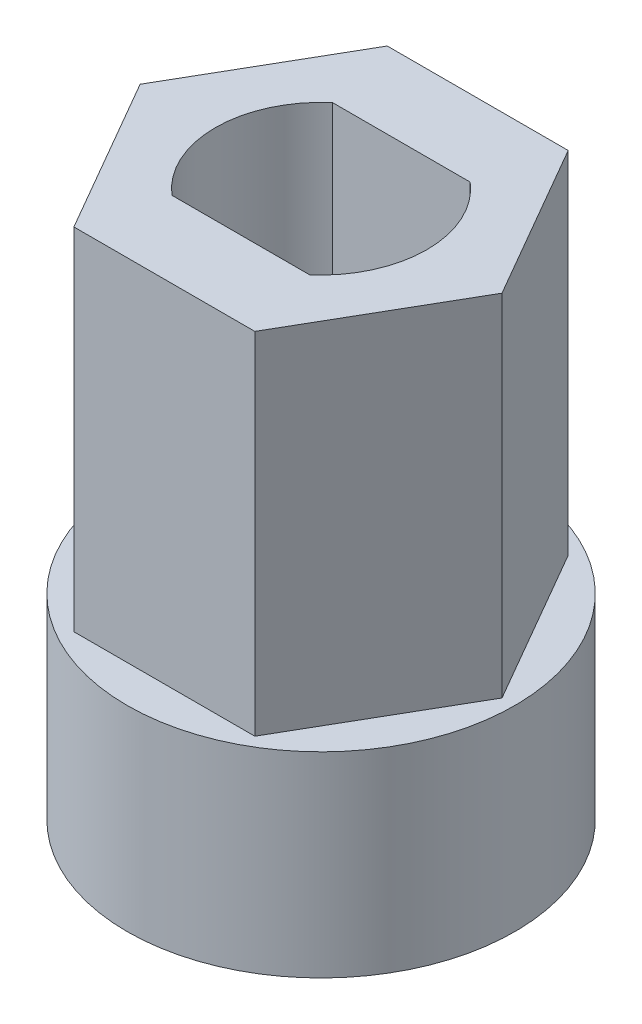
ISO-10303-21;
HEADER;
FILE_DESCRIPTION(('STEP AP214'),'2;1');
FILE_NAME('part.step','',(''),(''),'','','');
FILE_SCHEMA(('AUTOMOTIVE_DESIGN { 1 0 10303 214 1 1 1 1 }'));
ENDSEC;
DATA;
#1=APPLICATION_CONTEXT('core data for automotive mechanical design processes');
#2=APPLICATION_PROTOCOL_DEFINITION('international standard','automotive_design',2000,#1);
#3=PRODUCT_CONTEXT('',#1,'mechanical');
#4=PRODUCT('Part','Part','',(#3));
#5=PRODUCT_RELATED_PRODUCT_CATEGORY('part','',(#4));
#6=PRODUCT_DEFINITION_FORMATION('','',#4);
#7=PRODUCT_DEFINITION_CONTEXT('part definition',#1,'design');
#8=PRODUCT_DEFINITION('design','',#6,#7);
#9=PRODUCT_DEFINITION_SHAPE('','',#8);
#10=(LENGTH_UNIT() NAMED_UNIT(*) SI_UNIT(.MILLI.,.METRE.));
#11=(NAMED_UNIT(*) PLANE_ANGLE_UNIT() SI_UNIT($,.RADIAN.));
#12=(NAMED_UNIT(*) SI_UNIT($,.STERADIAN.) SOLID_ANGLE_UNIT());
#13=UNCERTAINTY_MEASURE_WITH_UNIT(LENGTH_MEASURE(1.E-05),#10,'distance_accuracy_value','');
#14=(GEOMETRIC_REPRESENTATION_CONTEXT(3) GLOBAL_UNCERTAINTY_ASSIGNED_CONTEXT((#13)) GLOBAL_UNIT_ASSIGNED_CONTEXT((#10,
#11,#12)) REPRESENTATION_CONTEXT('',''));
#15=CARTESIAN_POINT('',(0.,0.,0.));
#16=DIRECTION('',(0.,0.,1.));
#17=DIRECTION('',(1.,0.,0.));
#18=AXIS2_PLACEMENT_3D('',#15,#16,#17);
#19=CARTESIAN_POINT('',(3.46410161513775,8.95,2.));
#20=DIRECTION('',(-0.866025403784438,0.,-0.5));
#21=DIRECTION('',(-0.5,0.,0.866025403784439));
#22=AXIS2_PLACEMENT_3D('',#19,#20,#21);
#23=PLANE('',#22);
#24=DIRECTION('',(0.5,0.,-0.866025403784439));
#25=VECTOR('',#24,1.);
#26=CARTESIAN_POINT('',(3.46410161513775,0.,2.));
#27=LINE('',#26,#25);
#28=CARTESIAN_POINT('',(2.3094010767585,0.,4.));
#29=VERTEX_POINT('',#28);
#30=CARTESIAN_POINT('',(4.61880215351701,0.,0.));
#31=VERTEX_POINT('',#30);
#32=EDGE_CURVE('E158',#29,#31,#27,.T.);
#33=ORIENTED_EDGE('',*,*,#32,.T.);
#34=DIRECTION('',(0.,-1.,0.));
#35=VECTOR('',#34,1.);
#36=CARTESIAN_POINT('',(4.61880215351701,8.95,0.));
#37=LINE('',#36,#35);
#38=CARTESIAN_POINT('',(4.61880215351701,8.95,0.));
#39=VERTEX_POINT('',#38);
#40=EDGE_CURVE('E11',#39,#31,#37,.T.);
#41=ORIENTED_EDGE('',*,*,#40,.F.);
#42=DIRECTION('',(0.5,0.,-0.866025403784439));
#43=VECTOR('',#42,1.);
#44=CARTESIAN_POINT('',(3.46410161513775,8.95,2.));
#45=LINE('',#44,#43);
#46=CARTESIAN_POINT('',(2.3094010767585,8.95,4.));
#47=VERTEX_POINT('',#46);
#48=EDGE_CURVE('E175',#47,#39,#45,.T.);
#49=ORIENTED_EDGE('',*,*,#48,.F.);
#50=DIRECTION('',(0.,-1.,0.));
#51=VECTOR('',#50,1.);
#52=CARTESIAN_POINT('',(2.3094010767585,8.95,4.));
#53=LINE('',#52,#51);
#54=EDGE_CURVE('E129',#47,#29,#53,.T.);
#55=ORIENTED_EDGE('',*,*,#54,.T.);
#56=EDGE_LOOP('',(#33,#41,#49,#55));
#57=FACE_BOUND('',#56,.T.);
#58=ADVANCED_FACE('F43',(#57),#23,.F.);
#59=CARTESIAN_POINT('',(3.46410161513775,8.95,-2.));
#60=DIRECTION('',(-0.866025403784439,0.,0.5));
#61=DIRECTION('',(0.5,0.,0.866025403784439));
#62=AXIS2_PLACEMENT_3D('',#59,#60,#61);
#63=PLANE('',#62);
#64=DIRECTION('',(-0.5,0.,-0.866025403784439));
#65=VECTOR('',#64,1.);
#66=CARTESIAN_POINT('',(3.46410161513775,0.,-2.));
#67=LINE('',#66,#65);
#68=CARTESIAN_POINT('',(2.3094010767585,0.,-4.));
#69=VERTEX_POINT('',#68);
#70=EDGE_CURVE('E195',#31,#69,#67,.T.);
#71=ORIENTED_EDGE('',*,*,#70,.T.);
#72=DIRECTION('',(0.,-1.,0.));
#73=VECTOR('',#72,1.);
#74=CARTESIAN_POINT('',(2.3094010767585,8.95,-4.));
#75=LINE('',#74,#73);
#76=CARTESIAN_POINT('',(2.3094010767585,8.95,-4.));
#77=VERTEX_POINT('',#76);
#78=EDGE_CURVE('E54',#77,#69,#75,.T.);
#79=ORIENTED_EDGE('',*,*,#78,.F.);
#80=DIRECTION('',(-0.5,0.,-0.866025403784439));
#81=VECTOR('',#80,1.);
#82=CARTESIAN_POINT('',(3.46410161513775,8.95,-2.));
#83=LINE('',#82,#81);
#84=EDGE_CURVE('E178',#39,#77,#83,.T.);
#85=ORIENTED_EDGE('',*,*,#84,.F.);
#86=ORIENTED_EDGE('',*,*,#40,.T.);
#87=EDGE_LOOP('',(#71,#79,#85,#86));
#88=FACE_BOUND('',#87,.T.);
#89=ADVANCED_FACE('F258',(#88),#63,.F.);
#90=CARTESIAN_POINT('',(0.,8.95,-4.));
#91=DIRECTION('',(0.,0.,1.));
#92=DIRECTION('',(1.,0.,0.));
#93=AXIS2_PLACEMENT_3D('',#90,#91,#92);
#94=PLANE('',#93);
#95=DIRECTION('',(-1.,0.,0.));
#96=VECTOR('',#95,1.);
#97=CARTESIAN_POINT('',(0.,0.,-4.));
#98=LINE('',#97,#96);
#99=CARTESIAN_POINT('',(-2.3094010767585,0.,-4.));
#100=VERTEX_POINT('',#99);
#101=EDGE_CURVE('E199',#69,#100,#98,.T.);
#102=ORIENTED_EDGE('',*,*,#101,.T.);
#103=DIRECTION('',(0.,-1.,0.));
#104=VECTOR('',#103,1.);
#105=CARTESIAN_POINT('',(-2.3094010767585,8.95,-4.));
#106=LINE('',#105,#104);
#107=CARTESIAN_POINT('',(-2.3094010767585,8.95,-4.));
#108=VERTEX_POINT('',#107);
#109=EDGE_CURVE('E225',#108,#100,#106,.T.);
#110=ORIENTED_EDGE('',*,*,#109,.F.);
#111=DIRECTION('',(-1.,0.,0.));
#112=VECTOR('',#111,1.);
#113=CARTESIAN_POINT('',(0.,8.95,-4.));
#114=LINE('',#113,#112);
#115=EDGE_CURVE('E181',#77,#108,#114,.T.);
#116=ORIENTED_EDGE('',*,*,#115,.F.);
#117=ORIENTED_EDGE('',*,*,#78,.T.);
#118=EDGE_LOOP('',(#102,#110,#116,#117));
#119=FACE_BOUND('',#118,.T.);
#120=ADVANCED_FACE('F263',(#119),#94,.F.);
#121=CARTESIAN_POINT('',(-3.46410161513775,8.95,-2.));
#122=DIRECTION('',(0.866025403784439,0.,0.5));
#123=DIRECTION('',(0.5,0.,-0.866025403784439));
#124=AXIS2_PLACEMENT_3D('',#121,#122,#123);
#125=PLANE('',#124);
#126=DIRECTION('',(-0.5,0.,0.866025403784439));
#127=VECTOR('',#126,1.);
#128=CARTESIAN_POINT('',(-3.46410161513775,0.,-2.));
#129=LINE('',#128,#127);
#130=CARTESIAN_POINT('',(-4.61880215351701,0.,0.));
#131=VERTEX_POINT('',#130);
#132=EDGE_CURVE('E203',#100,#131,#129,.T.);
#133=ORIENTED_EDGE('',*,*,#132,.T.);
#134=DIRECTION('',(0.,-1.,0.));
#135=VECTOR('',#134,1.);
#136=CARTESIAN_POINT('',(-4.61880215351701,8.95,0.));
#137=LINE('',#136,#135);
#138=CARTESIAN_POINT('',(-4.61880215351701,8.95,0.));
#139=VERTEX_POINT('',#138);
#140=EDGE_CURVE('E221',#139,#131,#137,.T.);
#141=ORIENTED_EDGE('',*,*,#140,.F.);
#142=DIRECTION('',(-0.5,0.,0.866025403784439));
#143=VECTOR('',#142,1.);
#144=CARTESIAN_POINT('',(-3.46410161513775,8.95,-2.));
#145=LINE('',#144,#143);
#146=EDGE_CURVE('E184',#108,#139,#145,.T.);
#147=ORIENTED_EDGE('',*,*,#146,.F.);
#148=ORIENTED_EDGE('',*,*,#109,.T.);
#149=EDGE_LOOP('',(#133,#141,#147,#148));
#150=FACE_BOUND('',#149,.T.);
#151=ADVANCED_FACE('F269',(#150),#125,.F.);
#152=CARTESIAN_POINT('',(-3.46410161513775,8.95,2.));
#153=DIRECTION('',(0.866025403784438,0.,-0.5));
#154=DIRECTION('',(-0.5,0.,-0.866025403784439));
#155=AXIS2_PLACEMENT_3D('',#152,#153,#154);
#156=PLANE('',#155);
#157=DIRECTION('',(0.5,0.,0.866025403784439));
#158=VECTOR('',#157,1.);
#159=CARTESIAN_POINT('',(-3.46410161513775,0.,2.));
#160=LINE('',#159,#158);
#161=CARTESIAN_POINT('',(-2.3094010767585,0.,4.));
#162=VERTEX_POINT('',#161);
#163=EDGE_CURVE('E207',#131,#162,#160,.T.);
#164=ORIENTED_EDGE('',*,*,#163,.T.);
#165=DIRECTION('',(0.,-1.,0.));
#166=VECTOR('',#165,1.);
#167=CARTESIAN_POINT('',(-2.3094010767585,8.95,4.));
#168=LINE('',#167,#166);
#169=CARTESIAN_POINT('',(-2.3094010767585,8.95,4.));
#170=VERTEX_POINT('',#169);
#171=EDGE_CURVE('E217',#170,#162,#168,.T.);
#172=ORIENTED_EDGE('',*,*,#171,.F.);
#173=DIRECTION('',(0.5,0.,0.866025403784439));
#174=VECTOR('',#173,1.);
#175=CARTESIAN_POINT('',(-3.46410161513775,8.95,2.));
#176=LINE('',#175,#174);
#177=EDGE_CURVE('E187',#139,#170,#176,.T.);
#178=ORIENTED_EDGE('',*,*,#177,.F.);
#179=ORIENTED_EDGE('',*,*,#140,.T.);
#180=EDGE_LOOP('',(#164,#172,#178,#179));
#181=FACE_BOUND('',#180,.T.);
#182=ADVANCED_FACE('F273',(#181),#156,.F.);
#183=CARTESIAN_POINT('',(0.,8.95,0.));
#184=DIRECTION('',(0.,-1.,0.));
#185=DIRECTION('',(0.,0.,-1.));
#186=AXIS2_PLACEMENT_3D('',#183,#184,#185);
#187=CYLINDRICAL_SURFACE('',#186,2.7);
#188=DIRECTION('',(0.,-1.,0.));
#189=VECTOR('',#188,1.);
#190=CARTESIAN_POINT('',(1.75712833908056,8.95,-2.05));
#191=LINE('',#190,#189);
#192=CARTESIAN_POINT('',(1.75712833908056,8.95,-2.05));
#193=VERTEX_POINT('',#192);
#194=CARTESIAN_POINT('',(1.75712833908056,-5.,-2.05));
#195=VERTEX_POINT('',#194);
#196=EDGE_CURVE('E143',#193,#195,#191,.T.);
#197=ORIENTED_EDGE('',*,*,#196,.T.);
#198=CARTESIAN_POINT('',(0.,-5.,0.));
#199=DIRECTION('',(0.,1.,0.));
#200=DIRECTION('',(0.,0.,1.));
#201=AXIS2_PLACEMENT_3D('',#198,#199,#200);
#202=CIRCLE('',#201,2.7);
#203=CARTESIAN_POINT('',(1.75712833908056,-5.,2.05));
#204=VERTEX_POINT('',#203);
#205=EDGE_CURVE('E136',#204,#195,#202,.T.);
#206=ORIENTED_EDGE('',*,*,#205,.F.);
#207=DIRECTION('',(0.,-1.,0.));
#208=VECTOR('',#207,1.);
#209=CARTESIAN_POINT('',(1.75712833908056,8.95,2.05));
#210=LINE('',#209,#208);
#211=CARTESIAN_POINT('',(1.75712833908056,8.95,2.05));
#212=VERTEX_POINT('',#211);
#213=EDGE_CURVE('E47',#212,#204,#210,.T.);
#214=ORIENTED_EDGE('',*,*,#213,.F.);
#215=CARTESIAN_POINT('',(0.,8.95,0.));
#216=DIRECTION('',(0.,1.,0.));
#217=DIRECTION('',(0.,0.,1.));
#218=AXIS2_PLACEMENT_3D('',#215,#216,#217);
#219=CIRCLE('',#218,2.7);
#220=EDGE_CURVE('E162',#212,#193,#219,.T.);
#221=ORIENTED_EDGE('',*,*,#220,.T.);
#222=EDGE_LOOP('',(#197,#206,#214,#221));
#223=FACE_BOUND('',#222,.T.);
#224=ADVANCED_FACE('F45',(#223),#187,.F.);
#225=CARTESIAN_POINT('',(0.,8.95,2.05));
#226=DIRECTION('',(0.,0.,-1.));
#227=DIRECTION('',(-1.,0.,0.));
#228=AXIS2_PLACEMENT_3D('',#225,#226,#227);
#229=PLANE('',#228);
#230=ORIENTED_EDGE('',*,*,#213,.T.);
#231=DIRECTION('',(1.,0.,0.));
#232=VECTOR('',#231,1.);
#233=CARTESIAN_POINT('',(0.,-5.,2.05));
#234=LINE('',#233,#232);
#235=CARTESIAN_POINT('',(-1.75712833908056,-5.,2.05));
#236=VERTEX_POINT('',#235);
#237=EDGE_CURVE('E121',#236,#204,#234,.T.);
#238=ORIENTED_EDGE('',*,*,#237,.F.);
#239=DIRECTION('',(0.,-1.,0.));
#240=VECTOR('',#239,1.);
#241=CARTESIAN_POINT('',(-1.75712833908056,8.95,2.05));
#242=LINE('',#241,#240);
#243=CARTESIAN_POINT('',(-1.75712833908056,8.95,2.05));
#244=VERTEX_POINT('',#243);
#245=EDGE_CURVE('E130',#244,#236,#242,.T.);
#246=ORIENTED_EDGE('',*,*,#245,.F.);
#247=DIRECTION('',(1.,0.,0.));
#248=VECTOR('',#247,1.);
#249=CARTESIAN_POINT('',(0.,8.95,2.05));
#250=LINE('',#249,#248);
#251=EDGE_CURVE('E123',#244,#212,#250,.T.);
#252=ORIENTED_EDGE('',*,*,#251,.T.);
#253=EDGE_LOOP('',(#230,#238,#246,#252));
#254=FACE_BOUND('',#253,.T.);
#255=ADVANCED_FACE('F120',(#254),#229,.T.);
#256=CARTESIAN_POINT('',(0.,8.95,0.));
#257=DIRECTION('',(0.,-1.,0.));
#258=DIRECTION('',(0.,0.,-1.));
#259=AXIS2_PLACEMENT_3D('',#256,#257,#258);
#260=CYLINDRICAL_SURFACE('',#259,2.7);
#261=ORIENTED_EDGE('',*,*,#245,.T.);
#262=CARTESIAN_POINT('',(0.,-5.,0.));
#263=DIRECTION('',(0.,1.,0.));
#264=DIRECTION('',(0.,0.,1.));
#265=AXIS2_PLACEMENT_3D('',#262,#263,#264);
#266=CIRCLE('',#265,2.7);
#267=CARTESIAN_POINT('',(-1.75712833908056,-5.,-2.05));
#268=VERTEX_POINT('',#267);
#269=EDGE_CURVE('E139',#268,#236,#266,.T.);
#270=ORIENTED_EDGE('',*,*,#269,.F.);
#271=DIRECTION('',(0.,-1.,0.));
#272=VECTOR('',#271,1.);
#273=CARTESIAN_POINT('',(-1.75712833908056,8.95,-2.05));
#274=LINE('',#273,#272);
#275=CARTESIAN_POINT('',(-1.75712833908056,8.95,-2.05));
#276=VERTEX_POINT('',#275);
#277=EDGE_CURVE('E234',#276,#268,#274,.T.);
#278=ORIENTED_EDGE('',*,*,#277,.F.);
#279=CARTESIAN_POINT('',(0.,8.95,0.));
#280=DIRECTION('',(0.,1.,0.));
#281=DIRECTION('',(0.,0.,1.));
#282=AXIS2_PLACEMENT_3D('',#279,#280,#281);
#283=CIRCLE('',#282,2.7);
#284=EDGE_CURVE('E168',#276,#244,#283,.T.);
#285=ORIENTED_EDGE('',*,*,#284,.T.);
#286=EDGE_LOOP('',(#261,#270,#278,#285));
#287=FACE_BOUND('',#286,.T.);
#288=ADVANCED_FACE('F239',(#287),#260,.F.);
#289=CARTESIAN_POINT('',(0.,8.95,-2.05));
#290=DIRECTION('',(0.,0.,-1.));
#291=DIRECTION('',(-1.,0.,0.));
#292=AXIS2_PLACEMENT_3D('',#289,#290,#291);
#293=PLANE('',#292);
#294=ORIENTED_EDGE('',*,*,#277,.T.);
#295=DIRECTION('',(1.,0.,0.));
#296=VECTOR('',#295,1.);
#297=CARTESIAN_POINT('',(0.,-5.,-2.05));
#298=LINE('',#297,#296);
#299=EDGE_CURVE('E155',#268,#195,#298,.T.);
#300=ORIENTED_EDGE('',*,*,#299,.T.);
#301=ORIENTED_EDGE('',*,*,#196,.F.);
#302=DIRECTION('',(1.,0.,0.));
#303=VECTOR('',#302,1.);
#304=CARTESIAN_POINT('',(0.,8.95,-2.05));
#305=LINE('',#304,#303);
#306=EDGE_CURVE('E172',#276,#193,#305,.T.);
#307=ORIENTED_EDGE('',*,*,#306,.F.);
#308=EDGE_LOOP('',(#294,#300,#301,#307));
#309=FACE_BOUND('',#308,.T.);
#310=ADVANCED_FACE('F245',(#309),#293,.F.);
#311=CARTESIAN_POINT('',(0.,8.95,4.));
#312=DIRECTION('',(0.,0.,-1.));
#313=DIRECTION('',(-1.,0.,0.));
#314=AXIS2_PLACEMENT_3D('',#311,#312,#313);
#315=PLANE('',#314);
#316=DIRECTION('',(1.,0.,0.));
#317=VECTOR('',#316,1.);
#318=CARTESIAN_POINT('',(0.,0.,4.));
#319=LINE('',#318,#317);
#320=EDGE_CURVE('E165',#162,#29,#319,.T.);
#321=ORIENTED_EDGE('',*,*,#320,.T.);
#322=ORIENTED_EDGE('',*,*,#54,.F.);
#323=DIRECTION('',(1.,0.,0.));
#324=VECTOR('',#323,1.);
#325=CARTESIAN_POINT('',(0.,8.95,4.));
#326=LINE('',#325,#324);
#327=EDGE_CURVE('E62',#170,#47,#326,.T.);
#328=ORIENTED_EDGE('',*,*,#327,.F.);
#329=ORIENTED_EDGE('',*,*,#171,.T.);
#330=EDGE_LOOP('',(#321,#322,#328,#329));
#331=FACE_BOUND('',#330,.T.);
#332=ADVANCED_FACE('F247',(#331),#315,.F.);
#333=CARTESIAN_POINT('',(0.,8.95,0.));
#334=DIRECTION('',(0.,1.,0.));
#335=DIRECTION('',(0.,0.,1.));
#336=AXIS2_PLACEMENT_3D('',#333,#334,#335);
#337=PLANE('',#336);
#338=ORIENTED_EDGE('',*,*,#220,.F.);
#339=ORIENTED_EDGE('',*,*,#251,.F.);
#340=ORIENTED_EDGE('',*,*,#284,.F.);
#341=ORIENTED_EDGE('',*,*,#306,.T.);
#342=EDGE_LOOP('',(#338,#339,#340,#341));
#343=FACE_BOUND('',#342,.T.);
#344=ORIENTED_EDGE('',*,*,#48,.T.);
#345=ORIENTED_EDGE('',*,*,#84,.T.);
#346=ORIENTED_EDGE('',*,*,#115,.T.);
#347=ORIENTED_EDGE('',*,*,#146,.T.);
#348=ORIENTED_EDGE('',*,*,#177,.T.);
#349=ORIENTED_EDGE('',*,*,#327,.T.);
#350=EDGE_LOOP('',(#344,#345,#346,#347,#348,#349));
#351=FACE_BOUND('',#350,.T.);
#352=ADVANCED_FACE('F242',(#343,#351),#337,.T.);
#353=CARTESIAN_POINT('',(0.,0.,0.));
#354=DIRECTION('',(0.,1.,0.));
#355=DIRECTION('',(0.,0.,1.));
#356=AXIS2_PLACEMENT_3D('',#353,#354,#355);
#357=PLANE('',#356);
#358=CARTESIAN_POINT('',(0.,0.,0.));
#359=DIRECTION('',(0.,1.,0.));
#360=DIRECTION('',(0.,0.,1.));
#361=AXIS2_PLACEMENT_3D('',#358,#359,#360);
#362=CIRCLE('',#361,4.95);
#363=CARTESIAN_POINT('',(0.,0.,4.95));
#364=VERTEX_POINT('',#363);
#365=EDGE_CURVE('E150',#364,#364,#362,.T.);
#366=ORIENTED_EDGE('',*,*,#365,.T.);
#367=EDGE_LOOP('',(#366));
#368=FACE_BOUND('',#367,.T.);
#369=ORIENTED_EDGE('',*,*,#32,.F.);
#370=ORIENTED_EDGE('',*,*,#320,.F.);
#371=ORIENTED_EDGE('',*,*,#163,.F.);
#372=ORIENTED_EDGE('',*,*,#132,.F.);
#373=ORIENTED_EDGE('',*,*,#101,.F.);
#374=ORIENTED_EDGE('',*,*,#70,.F.);
#375=EDGE_LOOP('',(#369,#370,#371,#372,#373,#374));
#376=FACE_BOUND('',#375,.T.);
#377=ADVANCED_FACE('F280',(#368,#376),#357,.T.);
#378=CARTESIAN_POINT('',(0.,-5.,0.));
#379=DIRECTION('',(0.,1.,0.));
#380=DIRECTION('',(0.,0.,1.));
#381=AXIS2_PLACEMENT_3D('',#378,#379,#380);
#382=CYLINDRICAL_SURFACE('',#381,4.95);
#383=CARTESIAN_POINT('',(0.,-5.,0.));
#384=DIRECTION('',(0.,1.,0.));
#385=DIRECTION('',(0.,0.,1.));
#386=AXIS2_PLACEMENT_3D('',#383,#384,#385);
#387=CIRCLE('',#386,4.95);
#388=CARTESIAN_POINT('',(0.,-5.,4.95));
#389=VERTEX_POINT('',#388);
#390=EDGE_CURVE('E145',#389,#389,#387,.T.);
#391=ORIENTED_EDGE('',*,*,#390,.T.);
#392=EDGE_LOOP('',(#391));
#393=FACE_BOUND('',#392,.T.);
#394=ORIENTED_EDGE('',*,*,#365,.F.);
#395=EDGE_LOOP('',(#394));
#396=FACE_BOUND('',#395,.T.);
#397=ADVANCED_FACE('F281',(#393,#396),#382,.T.);
#398=CARTESIAN_POINT('',(0.,-5.,0.));
#399=DIRECTION('',(0.,1.,0.));
#400=DIRECTION('',(0.,0.,1.));
#401=AXIS2_PLACEMENT_3D('',#398,#399,#400);
#402=PLANE('',#401);
#403=ORIENTED_EDGE('',*,*,#390,.F.);
#404=EDGE_LOOP('',(#403));
#405=FACE_BOUND('',#404,.T.);
#406=ORIENTED_EDGE('',*,*,#205,.T.);
#407=ORIENTED_EDGE('',*,*,#299,.F.);
#408=ORIENTED_EDGE('',*,*,#269,.T.);
#409=ORIENTED_EDGE('',*,*,#237,.T.);
#410=EDGE_LOOP('',(#406,#407,#408,#409));
#411=FACE_BOUND('',#410,.T.);
#412=ADVANCED_FACE('F134',(#405,#411),#402,.F.);
#413=CLOSED_SHELL('',(#58,#89,#120,#151,#182,#224,#255,#288,#310,#332,#352,#377,#397,#412));
#414=MANIFOLD_SOLID_BREP('B2',#413);
#415=ADVANCED_BREP_SHAPE_REPRESENTATION('',(#18,#414),#14);
#416=SHAPE_DEFINITION_REPRESENTATION(#9,#415);
ENDSEC;
END-ISO-10303-21;
